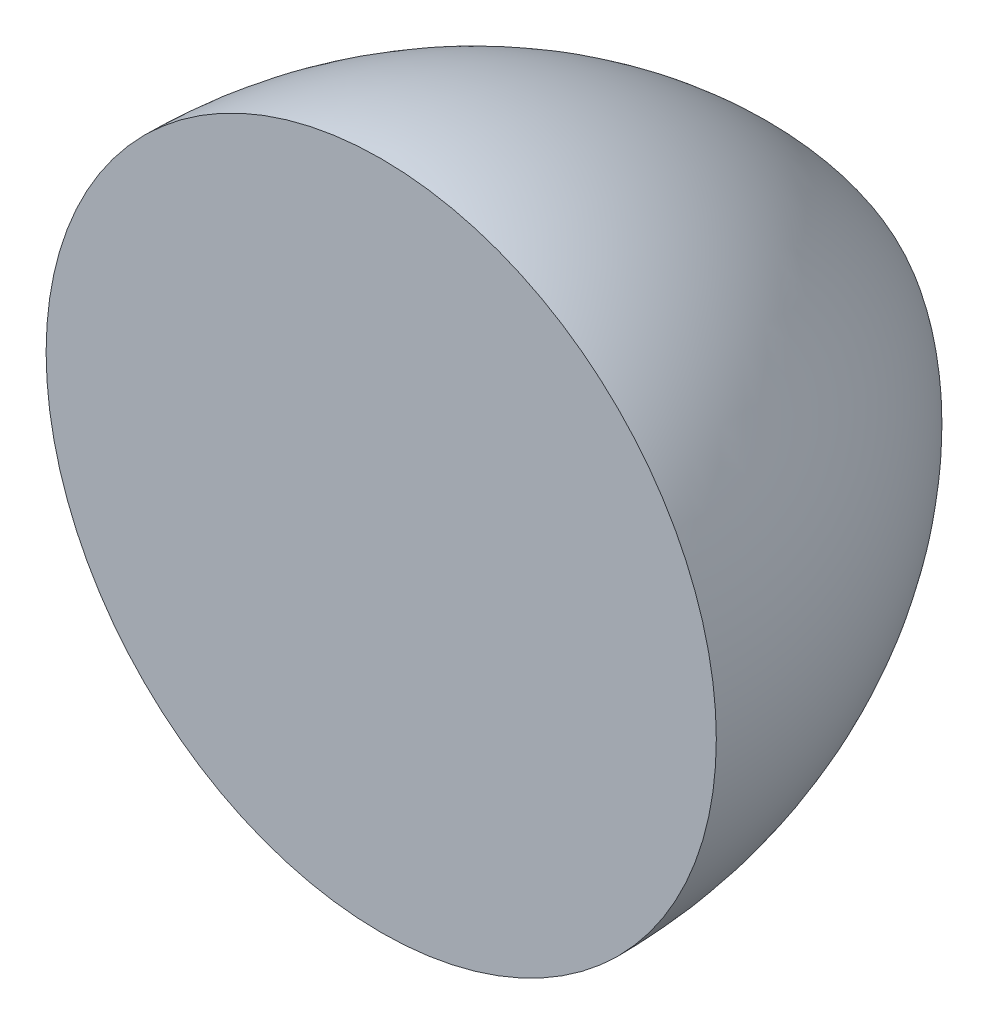
ISO-10303-21;
HEADER;
FILE_DESCRIPTION(('STEP AP214'),'2;1');
FILE_NAME('part.step','',(''),(''),'','','');
FILE_SCHEMA(('AUTOMOTIVE_DESIGN { 1 0 10303 214 1 1 1 1 }'));
ENDSEC;
DATA;
#1=APPLICATION_CONTEXT('core data for automotive mechanical design processes');
#2=APPLICATION_PROTOCOL_DEFINITION('international standard','automotive_design',2000,#1);
#3=PRODUCT_CONTEXT('',#1,'mechanical');
#4=PRODUCT('Part','Part','',(#3));
#5=PRODUCT_RELATED_PRODUCT_CATEGORY('part','',(#4));
#6=PRODUCT_DEFINITION_FORMATION('','',#4);
#7=PRODUCT_DEFINITION_CONTEXT('part definition',#1,'design');
#8=PRODUCT_DEFINITION('design','',#6,#7);
#9=PRODUCT_DEFINITION_SHAPE('','',#8);
#10=(LENGTH_UNIT() NAMED_UNIT(*) SI_UNIT(.MILLI.,.METRE.));
#11=(NAMED_UNIT(*) PLANE_ANGLE_UNIT() SI_UNIT($,.RADIAN.));
#12=(NAMED_UNIT(*) SI_UNIT($,.STERADIAN.) SOLID_ANGLE_UNIT());
#13=UNCERTAINTY_MEASURE_WITH_UNIT(LENGTH_MEASURE(1.E-05),#10,'distance_accuracy_value','');
#14=(GEOMETRIC_REPRESENTATION_CONTEXT(3) GLOBAL_UNCERTAINTY_ASSIGNED_CONTEXT((#13)) GLOBAL_UNIT_ASSIGNED_CONTEXT((#10,
#11,#12)) REPRESENTATION_CONTEXT('',''));
#15=CARTESIAN_POINT('',(0.,0.,0.));
#16=DIRECTION('',(0.,0.,1.));
#17=DIRECTION('',(1.,0.,0.));
#18=AXIS2_PLACEMENT_3D('',#15,#16,#17);
#19=CARTESIAN_POINT('',(0.,0.,0.));
#20=DIRECTION('',(0.,0.,-1.));
#21=DIRECTION('',(-1.,0.,0.));
#22=AXIS2_PLACEMENT_3D('',#19,#20,#21);
#23=PLANE('',#22);
#24=CARTESIAN_POINT('',(0.,0.,0.));
#25=DIRECTION('',(0.,0.,1.));
#26=DIRECTION('',(1.,0.,0.));
#27=AXIS2_PLACEMENT_3D('',#24,#25,#26);
#28=CIRCLE('',#27,100.);
#29=CARTESIAN_POINT('',(100.,0.,0.));
#30=VERTEX_POINT('',#29);
#31=EDGE_CURVE('E11',#30,#30,#28,.T.);
#32=ORIENTED_EDGE('',*,*,#31,.T.);
#33=EDGE_LOOP('',(#32));
#34=FACE_BOUND('',#33,.T.);
#35=ADVANCED_FACE('F33',(#34),#23,.F.);
#36=CARTESIAN_POINT('',(-62.4999999999999,0.,0.));
#37=DIRECTION('',(0.,-1.,0.));
#38=DIRECTION('',(1.,0.,0.));
#39=AXIS2_PLACEMENT_3D('',#36,#37,#38);
#40=CIRCLE('',#39,162.5);
#41=TRIMMED_CURVE('',#40,(PARAMETER_VALUE(-1.17600520709514)),
(PARAMETER_VALUE(1.17600520709514)),.T.,.PARAMETER.);
#42=CARTESIAN_POINT('',(0.,0.,0.));
#43=DIRECTION('',(0.,0.,1.));
#44=AXIS1_PLACEMENT('',#42,#43);
#45=SURFACE_OF_REVOLUTION('',#41,#44);
#46=ORIENTED_EDGE('',*,*,#31,.F.);
#47=EDGE_LOOP('',(#46));
#48=FACE_BOUND('',#47,.T.);
#49=CARTESIAN_POINT('',(0.,0.,-150.));
#50=VERTEX_POINT('',#49);
#51=VERTEX_LOOP('',#50);
#52=FACE_BOUND('',#51,.T.);
#53=ADVANCED_FACE('F40',(#48,#52),#45,.T.);
#54=CLOSED_SHELL('',(#35,#53));
#55=MANIFOLD_SOLID_BREP('B2',#54);
#56=ADVANCED_BREP_SHAPE_REPRESENTATION('',(#18,#55),#14);
#57=SHAPE_DEFINITION_REPRESENTATION(#9,#56);
ENDSEC;
END-ISO-10303-21;
